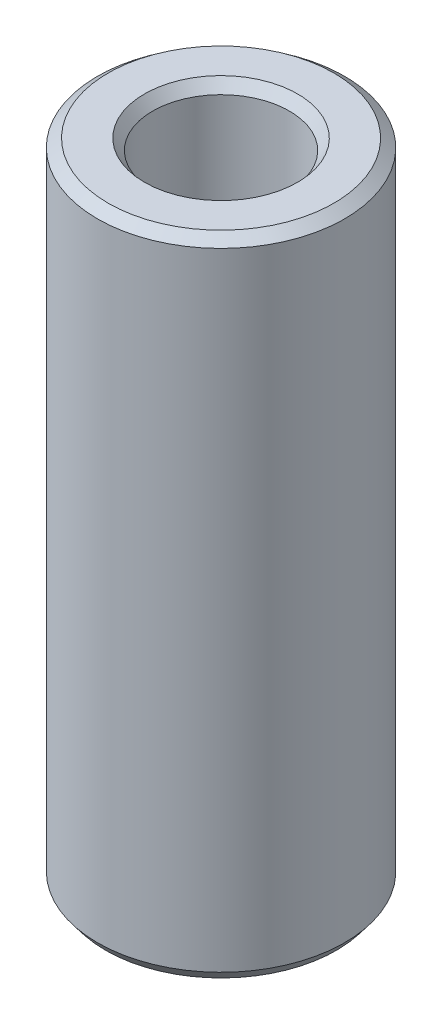
ISO-10303-21;
HEADER;
FILE_DESCRIPTION(('STEP AP214'),'2;1');
FILE_NAME('part.step','',(''),(''),'','','');
FILE_SCHEMA(('AUTOMOTIVE_DESIGN { 1 0 10303 214 1 1 1 1 }'));
ENDSEC;
DATA;
#1=APPLICATION_CONTEXT('core data for automotive mechanical design processes');
#2=APPLICATION_PROTOCOL_DEFINITION('international standard','automotive_design',2000,#1);
#3=PRODUCT_CONTEXT('',#1,'mechanical');
#4=PRODUCT('Part','Part','',(#3));
#5=PRODUCT_RELATED_PRODUCT_CATEGORY('part','',(#4));
#6=PRODUCT_DEFINITION_FORMATION('','',#4);
#7=PRODUCT_DEFINITION_CONTEXT('part definition',#1,'design');
#8=PRODUCT_DEFINITION('design','',#6,#7);
#9=PRODUCT_DEFINITION_SHAPE('','',#8);
#10=(LENGTH_UNIT() NAMED_UNIT(*) SI_UNIT(.MILLI.,.METRE.));
#11=(NAMED_UNIT(*) PLANE_ANGLE_UNIT() SI_UNIT($,.RADIAN.));
#12=(NAMED_UNIT(*) SI_UNIT($,.STERADIAN.) SOLID_ANGLE_UNIT());
#13=UNCERTAINTY_MEASURE_WITH_UNIT(LENGTH_MEASURE(1.E-05),#10,'distance_accuracy_value','');
#14=(GEOMETRIC_REPRESENTATION_CONTEXT(3) GLOBAL_UNCERTAINTY_ASSIGNED_CONTEXT((#13)) GLOBAL_UNIT_ASSIGNED_CONTEXT((#10,
#11,#12)) REPRESENTATION_CONTEXT('',''));
#15=CARTESIAN_POINT('',(0.,0.,0.));
#16=DIRECTION('',(0.,0.,1.));
#17=DIRECTION('',(1.,0.,0.));
#18=AXIS2_PLACEMENT_3D('',#15,#16,#17);
#19=CARTESIAN_POINT('',(0.,300.527660437193,0.));
#20=DIRECTION('',(0.,-1.,0.));
#21=DIRECTION('',(0.,0.,-1.));
#22=AXIS2_PLACEMENT_3D('',#19,#20,#21);
#23=CYLINDRICAL_SURFACE('',#22,57.5);
#24=CARTESIAN_POINT('',(0.,4.99300744964032,0.));
#25=DIRECTION('',(0.,1.,0.));
#26=DIRECTION('',(0.,0.,1.));
#27=AXIS2_PLACEMENT_3D('',#24,#25,#26);
#28=CIRCLE('',#27,57.5);
#29=CARTESIAN_POINT('',(0.,4.99300744964032,57.5));
#30=VERTEX_POINT('',#29);
#31=EDGE_CURVE('E10',#30,#30,#28,.T.);
#32=ORIENTED_EDGE('',*,*,#31,.T.);
#33=EDGE_LOOP('',(#32));
#34=FACE_BOUND('',#33,.T.);
#35=CARTESIAN_POINT('',(0.,296.718504432417,0.));
#36=DIRECTION('',(0.,1.,0.));
#37=DIRECTION('',(0.,0.,1.));
#38=AXIS2_PLACEMENT_3D('',#35,#36,#37);
#39=CIRCLE('',#38,57.5);
#40=CARTESIAN_POINT('',(0.,296.718504432417,57.5));
#41=VERTEX_POINT('',#40);
#42=EDGE_CURVE('E50',#41,#41,#39,.F.);
#43=ORIENTED_EDGE('',*,*,#42,.T.);
#44=EDGE_LOOP('',(#43));
#45=FACE_BOUND('',#44,.T.);
#46=ADVANCED_FACE('F39',(#34,#45),#23,.T.);
#47=CARTESIAN_POINT('',(0.,300.527660437193,0.));
#48=DIRECTION('',(0.,1.,0.));
#49=DIRECTION('',(0.,0.,1.));
#50=AXIS2_PLACEMENT_3D('',#47,#48,#49);
#51=PLANE('',#50);
#52=CARTESIAN_POINT('',(0.,300.527660437193,0.));
#53=DIRECTION('',(0.,1.,0.));
#54=DIRECTION('',(0.,0.,1.));
#55=AXIS2_PLACEMENT_3D('',#52,#53,#54);
#56=CIRCLE('',#55,35.6323242927143);
#57=CARTESIAN_POINT('',(0.,300.527660437193,35.6323242927143));
#58=VERTEX_POINT('',#57);
#59=EDGE_CURVE('E58',#58,#58,#56,.F.);
#60=ORIENTED_EDGE('',*,*,#59,.T.);
#61=EDGE_LOOP('',(#60));
#62=FACE_BOUND('',#61,.T.);
#63=CARTESIAN_POINT('',(0.,300.527660437193,0.));
#64=DIRECTION('',(0.,1.,0.));
#65=DIRECTION('',(0.,0.,1.));
#66=AXIS2_PLACEMENT_3D('',#63,#64,#65);
#67=CIRCLE('',#66,52.5069925503598);
#68=CARTESIAN_POINT('',(0.,300.527660437193,52.5069925503598));
#69=VERTEX_POINT('',#68);
#70=EDGE_CURVE('E61',#69,#69,#67,.T.);
#71=ORIENTED_EDGE('',*,*,#70,.T.);
#72=EDGE_LOOP('',(#71));
#73=FACE_BOUND('',#72,.T.);
#74=ADVANCED_FACE('F88',(#62,#73),#51,.T.);
#75=CARTESIAN_POINT('',(0.,0.,0.));
#76=DIRECTION('',(0.,1.,0.));
#77=DIRECTION('',(0.,0.,1.));
#78=AXIS2_PLACEMENT_3D('',#75,#76,#77);
#79=PLANE('',#78);
#80=CARTESIAN_POINT('',(0.,0.,0.));
#81=DIRECTION('',(0.,1.,0.));
#82=DIRECTION('',(0.,0.,1.));
#83=AXIS2_PLACEMENT_3D('',#80,#81,#82);
#84=CIRCLE('',#83,36.8161757375787);
#85=CARTESIAN_POINT('',(0.,0.,36.8161757375787));
#86=VERTEX_POINT('',#85);
#87=EDGE_CURVE('E51',#86,#86,#84,.T.);
#88=ORIENTED_EDGE('',*,*,#87,.T.);
#89=EDGE_LOOP('',(#88));
#90=FACE_BOUND('',#89,.T.);
#91=CARTESIAN_POINT('',(0.,0.,0.));
#92=DIRECTION('',(0.,1.,0.));
#93=DIRECTION('',(0.,0.,1.));
#94=AXIS2_PLACEMENT_3D('',#91,#92,#93);
#95=CIRCLE('',#94,53.690843995224);
#96=CARTESIAN_POINT('',(0.,0.,53.690843995224));
#97=VERTEX_POINT('',#96);
#98=EDGE_CURVE('E54',#97,#97,#95,.F.);
#99=ORIENTED_EDGE('',*,*,#98,.T.);
#100=EDGE_LOOP('',(#99));
#101=FACE_BOUND('',#100,.T.);
#102=ADVANCED_FACE('F83',(#90,#101),#79,.F.);
#103=CARTESIAN_POINT('',(0.,300.527660437193,0.));
#104=DIRECTION('',(0.,-1.,0.));
#105=DIRECTION('',(0.,0.,-1.));
#106=AXIS2_PLACEMENT_3D('',#103,#104,#105);
#107=CYLINDRICAL_SURFACE('',#106,31.8231682879384);
#108=CARTESIAN_POINT('',(0.,295.534652987552,0.));
#109=DIRECTION('',(0.,1.,0.));
#110=DIRECTION('',(0.,0.,1.));
#111=AXIS2_PLACEMENT_3D('',#108,#109,#110);
#112=CIRCLE('',#111,31.8231682879384);
#113=CARTESIAN_POINT('',(0.,295.534652987552,31.8231682879384));
#114=VERTEX_POINT('',#113);
#115=EDGE_CURVE('E67',#114,#114,#112,.T.);
#116=ORIENTED_EDGE('',*,*,#115,.T.);
#117=EDGE_LOOP('',(#116));
#118=FACE_BOUND('',#117,.T.);
#119=CARTESIAN_POINT('',(0.,3.80915600477594,0.));
#120=DIRECTION('',(0.,1.,0.));
#121=DIRECTION('',(0.,0.,1.));
#122=AXIS2_PLACEMENT_3D('',#119,#120,#121);
#123=CIRCLE('',#122,31.8231682879384);
#124=CARTESIAN_POINT('',(0.,3.80915600477594,31.8231682879384));
#125=VERTEX_POINT('',#124);
#126=EDGE_CURVE('E69',#125,#125,#123,.F.);
#127=ORIENTED_EDGE('',*,*,#126,.T.);
#128=EDGE_LOOP('',(#127));
#129=FACE_BOUND('',#128,.T.);
#130=ADVANCED_FACE('F71',(#118,#129),#107,.F.);
#131=CARTESIAN_POINT('',(0.,295.534652987552,0.));
#132=DIRECTION('',(0.,1.,0.));
#133=DIRECTION('',(0.,0.,1.));
#134=AXIS2_PLACEMENT_3D('',#131,#132,#133);
#135=CONICAL_SURFACE('',#134,31.8231682879384,0.651704930796949);
#136=ORIENTED_EDGE('',*,*,#59,.F.);
#137=EDGE_LOOP('',(#136));
#138=FACE_BOUND('',#137,.T.);
#139=ORIENTED_EDGE('',*,*,#115,.F.);
#140=EDGE_LOOP('',(#139));
#141=FACE_BOUND('',#140,.T.);
#142=ADVANCED_FACE('F77',(#138,#141),#135,.F.);
#143=CARTESIAN_POINT('',(0.,0.,0.));
#144=DIRECTION('',(0.,-1.,0.));
#145=DIRECTION('',(0.,0.,-1.));
#146=AXIS2_PLACEMENT_3D('',#143,#144,#145);
#147=CONICAL_SURFACE('',#146,36.8161757375787,0.91909139599795);
#148=ORIENTED_EDGE('',*,*,#126,.F.);
#149=EDGE_LOOP('',(#148));
#150=FACE_BOUND('',#149,.T.);
#151=ORIENTED_EDGE('',*,*,#87,.F.);
#152=EDGE_LOOP('',(#151));
#153=FACE_BOUND('',#152,.T.);
#154=ADVANCED_FACE('F73',(#150,#153),#147,.F.);
#155=CARTESIAN_POINT('',(0.,4.99300744964032,0.));
#156=DIRECTION('',(0.,1.,0.));
#157=DIRECTION('',(0.,0.,1.));
#158=AXIS2_PLACEMENT_3D('',#155,#156,#157);
#159=CONICAL_SURFACE('',#158,57.5,0.651704930796949);
#160=ORIENTED_EDGE('',*,*,#98,.F.);
#161=EDGE_LOOP('',(#160));
#162=FACE_BOUND('',#161,.T.);
#163=ORIENTED_EDGE('',*,*,#31,.F.);
#164=EDGE_LOOP('',(#163));
#165=FACE_BOUND('',#164,.T.);
#166=ADVANCED_FACE('F76',(#162,#165),#159,.T.);
#167=CARTESIAN_POINT('',(0.,300.527660437193,0.));
#168=DIRECTION('',(0.,-1.,0.));
#169=DIRECTION('',(0.,0.,-1.));
#170=AXIS2_PLACEMENT_3D('',#167,#168,#169);
#171=CONICAL_SURFACE('',#170,52.5069925503598,0.919091395997941);
#172=ORIENTED_EDGE('',*,*,#42,.F.);
#173=EDGE_LOOP('',(#172));
#174=FACE_BOUND('',#173,.T.);
#175=ORIENTED_EDGE('',*,*,#70,.F.);
#176=EDGE_LOOP('',(#175));
#177=FACE_BOUND('',#176,.T.);
#178=ADVANCED_FACE('F45',(#174,#177),#171,.T.);
#179=CLOSED_SHELL('',(#46,#74,#102,#130,#142,#154,#166,#178));
#180=MANIFOLD_SOLID_BREP('B2',#179);
#181=ADVANCED_BREP_SHAPE_REPRESENTATION('',(#18,#180),#14);
#182=SHAPE_DEFINITION_REPRESENTATION(#9,#181);
ENDSEC;
END-ISO-10303-21;
